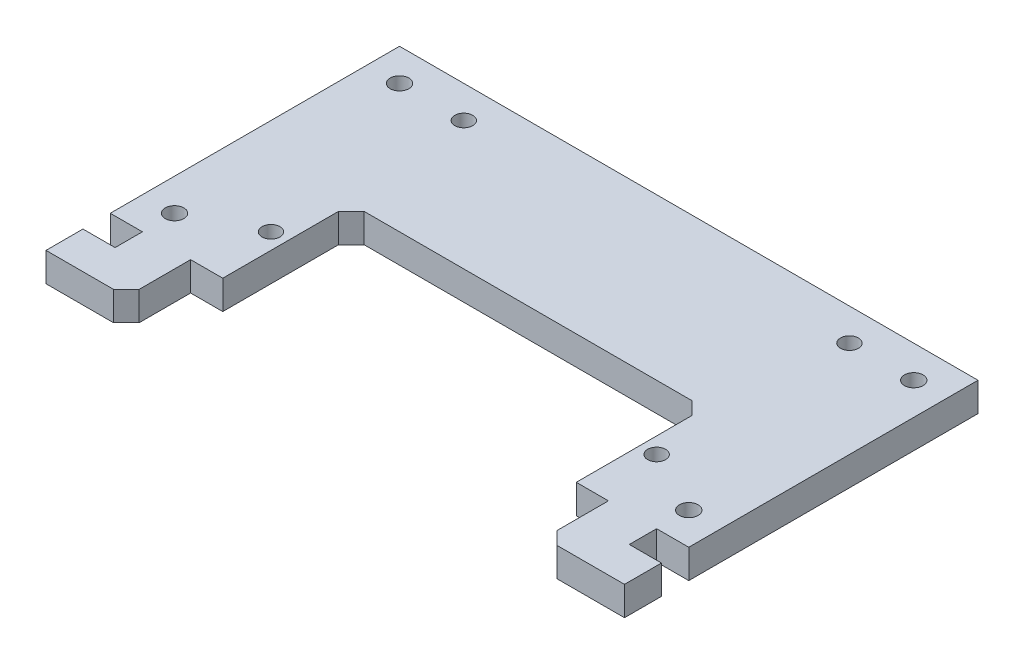
ISO-10303-21;
HEADER;
FILE_DESCRIPTION(('STEP AP214'),'2;1');
FILE_NAME('part.step','',(''),(''),'','','');
FILE_SCHEMA(('AUTOMOTIVE_DESIGN { 1 0 10303 214 1 1 1 1 }'));
ENDSEC;
DATA;
#1=APPLICATION_CONTEXT('core data for automotive mechanical design processes');
#2=APPLICATION_PROTOCOL_DEFINITION('international standard','automotive_design',2000,#1);
#3=PRODUCT_CONTEXT('',#1,'mechanical');
#4=PRODUCT('Part','Part','',(#3));
#5=PRODUCT_RELATED_PRODUCT_CATEGORY('part','',(#4));
#6=PRODUCT_DEFINITION_FORMATION('','',#4);
#7=PRODUCT_DEFINITION_CONTEXT('part definition',#1,'design');
#8=PRODUCT_DEFINITION('design','',#6,#7);
#9=PRODUCT_DEFINITION_SHAPE('','',#8);
#10=(LENGTH_UNIT() NAMED_UNIT(*) SI_UNIT(.MILLI.,.METRE.));
#11=(NAMED_UNIT(*) PLANE_ANGLE_UNIT() SI_UNIT($,.RADIAN.));
#12=(NAMED_UNIT(*) SI_UNIT($,.STERADIAN.) SOLID_ANGLE_UNIT());
#13=UNCERTAINTY_MEASURE_WITH_UNIT(LENGTH_MEASURE(1.E-05),#10,'distance_accuracy_value','');
#14=(GEOMETRIC_REPRESENTATION_CONTEXT(3) GLOBAL_UNCERTAINTY_ASSIGNED_CONTEXT((#13)) GLOBAL_UNIT_ASSIGNED_CONTEXT((#10,
#11,#12)) REPRESENTATION_CONTEXT('',''));
#15=CARTESIAN_POINT('',(0.,0.,0.));
#16=DIRECTION('',(0.,0.,1.));
#17=DIRECTION('',(1.,0.,0.));
#18=AXIS2_PLACEMENT_3D('',#15,#16,#17);
#19=CARTESIAN_POINT('',(-45.,4.5,55.));
#20=DIRECTION('',(0.,0.,-1.));
#21=DIRECTION('',(-1.,0.,0.));
#22=AXIS2_PLACEMENT_3D('',#19,#20,#21);
#23=PLANE('',#22);
#24=DIRECTION('',(1.,0.,0.));
#25=VECTOR('',#24,1.);
#26=CARTESIAN_POINT('',(-45.,0.,55.));
#27=LINE('',#26,#25);
#28=CARTESIAN_POINT('',(-45.,0.,55.));
#29=VERTEX_POINT('',#28);
#30=CARTESIAN_POINT('',(-34.5,0.,55.));
#31=VERTEX_POINT('',#30);
#32=EDGE_CURVE('E369',#29,#31,#27,.T.);
#33=ORIENTED_EDGE('',*,*,#32,.T.);
#34=DIRECTION('',(0.,1.,0.));
#35=VECTOR('',#34,1.);
#36=CARTESIAN_POINT('',(-34.5,4.5,55.));
#37=LINE('',#36,#35);
#38=CARTESIAN_POINT('',(-34.5,4.5,55.));
#39=VERTEX_POINT('',#38);
#40=EDGE_CURVE('E410',#31,#39,#37,.T.);
#41=ORIENTED_EDGE('',*,*,#40,.T.);
#42=DIRECTION('',(1.,0.,0.));
#43=VECTOR('',#42,1.);
#44=CARTESIAN_POINT('',(-45.,4.5,55.));
#45=LINE('',#44,#43);
#46=CARTESIAN_POINT('',(-45.,4.5,55.));
#47=VERTEX_POINT('',#46);
#48=EDGE_CURVE('E355',#47,#39,#45,.T.);
#49=ORIENTED_EDGE('',*,*,#48,.F.);
#50=DIRECTION('',(0.,-1.,0.));
#51=VECTOR('',#50,1.);
#52=CARTESIAN_POINT('',(-45.,4.5,55.));
#53=LINE('',#52,#51);
#54=EDGE_CURVE('E386',#47,#29,#53,.T.);
#55=ORIENTED_EDGE('',*,*,#54,.T.);
#56=EDGE_LOOP('',(#33,#41,#49,#55));
#57=FACE_BOUND('',#56,.T.);
#58=ADVANCED_FACE('F31',(#57),#23,.F.);
#59=CARTESIAN_POINT('',(-45.,4.5,55.));
#60=DIRECTION('',(0.,1.,0.));
#61=DIRECTION('',(0.,0.,1.));
#62=AXIS2_PLACEMENT_3D('',#59,#60,#61);
#63=PLANE('',#62);
#64=DIRECTION('',(0.,0.,-1.));
#65=VECTOR('',#64,1.);
#66=CARTESIAN_POINT('',(32.5,4.5,55.));
#67=LINE('',#66,#65);
#68=CARTESIAN_POINT('',(32.5,4.5,53.));
#69=VERTEX_POINT('',#68);
#70=CARTESIAN_POINT('',(32.5,4.5,45.));
#71=VERTEX_POINT('',#70);
#72=EDGE_CURVE('E212',#69,#71,#67,.T.);
#73=ORIENTED_EDGE('',*,*,#72,.F.);
#74=DIRECTION('',(-0.707106781186548,0.,-0.707106781186548));
#75=VECTOR('',#74,1.);
#76=CARTESIAN_POINT('',(-5.24999999999999,4.5,15.25));
#77=LINE('',#76,#75);
#78=CARTESIAN_POINT('',(34.5,4.5,55.));
#79=VERTEX_POINT('',#78);
#80=EDGE_CURVE('E394',#69,#79,#77,.F.);
#81=ORIENTED_EDGE('',*,*,#80,.T.);
#82=CARTESIAN_POINT('',(45.,4.5,55.));
#83=VERTEX_POINT('',#82);
#84=EDGE_CURVE('E353',#79,#83,#45,.T.);
#85=ORIENTED_EDGE('',*,*,#84,.T.);
#86=DIRECTION('',(0.,0.,-1.));
#87=VECTOR('',#86,1.);
#88=CARTESIAN_POINT('',(45.,4.5,0.));
#89=LINE('',#88,#87);
#90=CARTESIAN_POINT('',(45.,4.5,49.25));
#91=VERTEX_POINT('',#90);
#92=EDGE_CURVE('E359',#83,#91,#89,.T.);
#93=ORIENTED_EDGE('',*,*,#92,.T.);
#94=DIRECTION('',(1.,0.,0.));
#95=VECTOR('',#94,1.);
#96=CARTESIAN_POINT('',(45.,4.5,49.25));
#97=LINE('',#96,#95);
#98=CARTESIAN_POINT('',(40.,4.5,49.25));
#99=VERTEX_POINT('',#98);
#100=EDGE_CURVE('E278',#99,#91,#97,.T.);
#101=ORIENTED_EDGE('',*,*,#100,.F.);
#102=DIRECTION('',(0.,0.,1.));
#103=VECTOR('',#102,1.);
#104=CARTESIAN_POINT('',(40.,4.5,49.25));
#105=LINE('',#104,#103);
#106=CARTESIAN_POINT('',(40.,4.5,45.));
#107=VERTEX_POINT('',#106);
#108=EDGE_CURVE('E287',#107,#99,#105,.T.);
#109=ORIENTED_EDGE('',*,*,#108,.F.);
#110=DIRECTION('',(-1.,0.,0.));
#111=VECTOR('',#110,1.);
#112=CARTESIAN_POINT('',(45.,4.5,45.));
#113=LINE('',#112,#111);
#114=CARTESIAN_POINT('',(45.,4.5,45.));
#115=VERTEX_POINT('',#114);
#116=EDGE_CURVE('E271',#115,#107,#113,.T.);
#117=ORIENTED_EDGE('',*,*,#116,.F.);
#118=CARTESIAN_POINT('',(45.,4.5,0.));
#119=VERTEX_POINT('',#118);
#120=EDGE_CURVE('E358',#115,#119,#89,.T.);
#121=ORIENTED_EDGE('',*,*,#120,.T.);
#122=DIRECTION('',(-1.,0.,0.));
#123=VECTOR('',#122,1.);
#124=CARTESIAN_POINT('',(-45.,4.5,0.));
#125=LINE('',#124,#123);
#126=CARTESIAN_POINT('',(-45.,4.5,0.));
#127=VERTEX_POINT('',#126);
#128=EDGE_CURVE('E362',#119,#127,#125,.T.);
#129=ORIENTED_EDGE('',*,*,#128,.T.);
#130=DIRECTION('',(0.,0.,1.));
#131=VECTOR('',#130,1.);
#132=CARTESIAN_POINT('',(-45.,4.5,0.));
#133=LINE('',#132,#131);
#134=CARTESIAN_POINT('',(-45.,4.5,45.));
#135=VERTEX_POINT('',#134);
#136=EDGE_CURVE('E350',#127,#135,#133,.T.);
#137=ORIENTED_EDGE('',*,*,#136,.T.);
#138=DIRECTION('',(-1.,0.,0.));
#139=VECTOR('',#138,1.);
#140=CARTESIAN_POINT('',(-45.,4.5,45.));
#141=LINE('',#140,#139);
#142=CARTESIAN_POINT('',(-40.,4.5,45.));
#143=VERTEX_POINT('',#142);
#144=EDGE_CURVE('E304',#143,#135,#141,.T.);
#145=ORIENTED_EDGE('',*,*,#144,.F.);
#146=DIRECTION('',(0.,0.,-1.));
#147=VECTOR('',#146,1.);
#148=CARTESIAN_POINT('',(-40.,4.5,45.));
#149=LINE('',#148,#147);
#150=CARTESIAN_POINT('',(-40.,4.5,49.25));
#151=VERTEX_POINT('',#150);
#152=EDGE_CURVE('E313',#151,#143,#149,.T.);
#153=ORIENTED_EDGE('',*,*,#152,.F.);
#154=DIRECTION('',(1.,0.,0.));
#155=VECTOR('',#154,1.);
#156=CARTESIAN_POINT('',(-45.,4.5,49.25));
#157=LINE('',#156,#155);
#158=CARTESIAN_POINT('',(-45.,4.5,49.25));
#159=VERTEX_POINT('',#158);
#160=EDGE_CURVE('E294',#159,#151,#157,.T.);
#161=ORIENTED_EDGE('',*,*,#160,.F.);
#162=EDGE_CURVE('E354',#159,#47,#133,.T.);
#163=ORIENTED_EDGE('',*,*,#162,.T.);
#164=ORIENTED_EDGE('',*,*,#48,.T.);
#165=DIRECTION('',(-0.707106781186548,0.,0.707106781186548));
#166=VECTOR('',#165,1.);
#167=CARTESIAN_POINT('',(-39.75,4.5,60.25));
#168=LINE('',#167,#166);
#169=CARTESIAN_POINT('',(-32.5,4.5,53.));
#170=VERTEX_POINT('',#169);
#171=EDGE_CURVE('E392',#39,#170,#168,.F.);
#172=ORIENTED_EDGE('',*,*,#171,.T.);
#173=DIRECTION('',(0.,0.,1.));
#174=VECTOR('',#173,1.);
#175=CARTESIAN_POINT('',(-32.5,4.5,55.));
#176=LINE('',#175,#174);
#177=CARTESIAN_POINT('',(-32.5,4.5,45.));
#178=VERTEX_POINT('',#177);
#179=EDGE_CURVE('E224',#178,#170,#176,.T.);
#180=ORIENTED_EDGE('',*,*,#179,.F.);
#181=DIRECTION('',(-1.,0.,0.));
#182=VECTOR('',#181,1.);
#183=CARTESIAN_POINT('',(-32.5,4.5,45.));
#184=LINE('',#183,#182);
#185=CARTESIAN_POINT('',(-27.5,4.5,45.));
#186=VERTEX_POINT('',#185);
#187=EDGE_CURVE('E228',#186,#178,#184,.T.);
#188=ORIENTED_EDGE('',*,*,#187,.F.);
#189=DIRECTION('',(0.,0.,1.));
#190=VECTOR('',#189,1.);
#191=CARTESIAN_POINT('',(-27.5,4.5,55.));
#192=LINE('',#191,#190);
#193=CARTESIAN_POINT('',(-27.5,4.5,27.));
#194=VERTEX_POINT('',#193);
#195=EDGE_CURVE('E236',#194,#186,#192,.T.);
#196=ORIENTED_EDGE('',*,*,#195,.F.);
#197=DIRECTION('',(-0.707106781186545,0.,0.70710678118655));
#198=VECTOR('',#197,1.);
#199=CARTESIAN_POINT('',(-27.5,4.5,27.));
#200=LINE('',#199,#198);
#201=CARTESIAN_POINT('',(-25.5,4.5,25.));
#202=VERTEX_POINT('',#201);
#203=EDGE_CURVE('E39',#194,#202,#200,.F.);
#204=ORIENTED_EDGE('',*,*,#203,.T.);
#205=DIRECTION('',(-1.,0.,0.));
#206=VECTOR('',#205,1.);
#207=CARTESIAN_POINT('',(-27.5,4.5,25.));
#208=LINE('',#207,#206);
#209=CARTESIAN_POINT('',(25.5,4.5,25.));
#210=VERTEX_POINT('',#209);
#211=EDGE_CURVE('E240',#210,#202,#208,.T.);
#212=ORIENTED_EDGE('',*,*,#211,.F.);
#213=DIRECTION('',(-0.70710678118655,0.,-0.707106781186545));
#214=VECTOR('',#213,1.);
#215=CARTESIAN_POINT('',(25.5,4.5,25.));
#216=LINE('',#215,#214);
#217=CARTESIAN_POINT('',(27.5,4.5,27.));
#218=VERTEX_POINT('',#217);
#219=EDGE_CURVE('E415',#210,#218,#216,.F.);
#220=ORIENTED_EDGE('',*,*,#219,.T.);
#221=DIRECTION('',(0.,0.,-1.));
#222=VECTOR('',#221,1.);
#223=CARTESIAN_POINT('',(27.5,4.5,55.));
#224=LINE('',#223,#222);
#225=CARTESIAN_POINT('',(27.5,4.5,45.));
#226=VERTEX_POINT('',#225);
#227=EDGE_CURVE('E246',#226,#218,#224,.T.);
#228=ORIENTED_EDGE('',*,*,#227,.F.);
#229=EDGE_CURVE('E229',#71,#226,#184,.T.);
#230=ORIENTED_EDGE('',*,*,#229,.F.);
#231=EDGE_LOOP('',(#73,#81,#85,#93,#101,#109,#117,#121,#129,#137,#145,#153,#161,#163,#164,#172,
#180,#188,#196,#204,#212,#220,#228,#230));
#232=FACE_BOUND('',#231,.T.);
#233=CARTESIAN_POINT('',(30.,4.5,35.));
#234=DIRECTION('',(0.,-1.,0.));
#235=DIRECTION('',(0.,0.,1.));
#236=AXIS2_PLACEMENT_3D('',#233,#234,#235);
#237=CIRCLE('',#236,1.4);
#238=CARTESIAN_POINT('',(30.,4.5,36.4));
#239=VERTEX_POINT('',#238);
#240=EDGE_CURVE('E253',#239,#239,#237,.T.);
#241=ORIENTED_EDGE('',*,*,#240,.T.);
#242=EDGE_LOOP('',(#241));
#243=FACE_BOUND('',#242,.T.);
#244=CARTESIAN_POINT('',(-30.,4.5,5.));
#245=DIRECTION('',(0.,1.,0.));
#246=DIRECTION('',(0.,0.,1.));
#247=AXIS2_PLACEMENT_3D('',#244,#245,#246);
#248=CIRCLE('',#247,1.4);
#249=CARTESIAN_POINT('',(-30.,4.5,6.39999999999999));
#250=VERTEX_POINT('',#249);
#251=EDGE_CURVE('E259',#250,#250,#248,.T.);
#252=ORIENTED_EDGE('',*,*,#251,.F.);
#253=EDGE_LOOP('',(#252));
#254=FACE_BOUND('',#253,.T.);
#255=CARTESIAN_POINT('',(-30.,4.5,35.));
#256=DIRECTION('',(0.,1.,0.));
#257=DIRECTION('',(0.,0.,1.));
#258=AXIS2_PLACEMENT_3D('',#255,#256,#257);
#259=CIRCLE('',#258,1.4);
#260=CARTESIAN_POINT('',(-30.,4.5,36.4));
#261=VERTEX_POINT('',#260);
#262=EDGE_CURVE('E265',#261,#261,#259,.T.);
#263=ORIENTED_EDGE('',*,*,#262,.F.);
#264=EDGE_LOOP('',(#263));
#265=FACE_BOUND('',#264,.T.);
#266=CARTESIAN_POINT('',(40.,4.5,40.));
#267=DIRECTION('',(0.,1.,0.));
#268=DIRECTION('',(0.,0.,1.));
#269=AXIS2_PLACEMENT_3D('',#266,#267,#268);
#270=CIRCLE('',#269,1.45);
#271=CARTESIAN_POINT('',(40.,4.5,41.45));
#272=VERTEX_POINT('',#271);
#273=EDGE_CURVE('E332',#272,#272,#270,.T.);
#274=ORIENTED_EDGE('',*,*,#273,.F.);
#275=EDGE_LOOP('',(#274));
#276=FACE_BOUND('',#275,.T.);
#277=CARTESIAN_POINT('',(-40.,4.5,40.));
#278=DIRECTION('',(0.,1.,0.));
#279=DIRECTION('',(0.,0.,1.));
#280=AXIS2_PLACEMENT_3D('',#277,#278,#279);
#281=CIRCLE('',#280,1.45);
#282=CARTESIAN_POINT('',(-40.,4.5,41.45));
#283=VERTEX_POINT('',#282);
#284=EDGE_CURVE('E344',#283,#283,#281,.T.);
#285=ORIENTED_EDGE('',*,*,#284,.F.);
#286=EDGE_LOOP('',(#285));
#287=FACE_BOUND('',#286,.T.);
#288=CARTESIAN_POINT('',(-40.,4.5,5.));
#289=DIRECTION('',(0.,1.,0.));
#290=DIRECTION('',(0.,0.,1.));
#291=AXIS2_PLACEMENT_3D('',#288,#289,#290);
#292=CIRCLE('',#291,1.45);
#293=CARTESIAN_POINT('',(-40.,4.5,6.45));
#294=VERTEX_POINT('',#293);
#295=EDGE_CURVE('E338',#294,#294,#292,.T.);
#296=ORIENTED_EDGE('',*,*,#295,.F.);
#297=EDGE_LOOP('',(#296));
#298=FACE_BOUND('',#297,.T.);
#299=CARTESIAN_POINT('',(40.,4.5,5.));
#300=DIRECTION('',(0.,1.,0.));
#301=DIRECTION('',(0.,0.,1.));
#302=AXIS2_PLACEMENT_3D('',#299,#300,#301);
#303=CIRCLE('',#302,1.45);
#304=CARTESIAN_POINT('',(40.,4.5,6.45));
#305=VERTEX_POINT('',#304);
#306=EDGE_CURVE('E326',#305,#305,#303,.T.);
#307=ORIENTED_EDGE('',*,*,#306,.F.);
#308=EDGE_LOOP('',(#307));
#309=FACE_BOUND('',#308,.T.);
#310=CARTESIAN_POINT('',(30.,4.5,5.));
#311=DIRECTION('',(0.,-1.,0.));
#312=DIRECTION('',(0.,0.,1.));
#313=AXIS2_PLACEMENT_3D('',#310,#311,#312);
#314=CIRCLE('',#313,1.4);
#315=CARTESIAN_POINT('',(30.,4.5,6.39999999999999));
#316=VERTEX_POINT('',#315);
#317=EDGE_CURVE('E244',#316,#316,#314,.T.);
#318=ORIENTED_EDGE('',*,*,#317,.T.);
#319=EDGE_LOOP('',(#318));
#320=FACE_BOUND('',#319,.T.);
#321=ADVANCED_FACE('F421',(#232,#243,#254,#265,#276,#287,#298,#309,#320),#63,.T.);
#322=CARTESIAN_POINT('',(-45.,0.,55.));
#323=DIRECTION('',(0.,1.,0.));
#324=DIRECTION('',(0.,0.,1.));
#325=AXIS2_PLACEMENT_3D('',#322,#323,#324);
#326=PLANE('',#325);
#327=CARTESIAN_POINT('',(30.,0.,35.));
#328=DIRECTION('',(0.,-1.,0.));
#329=DIRECTION('',(0.,0.,1.));
#330=AXIS2_PLACEMENT_3D('',#327,#328,#329);
#331=CIRCLE('',#330,1.4);
#332=CARTESIAN_POINT('',(30.,0.,36.4));
#333=VERTEX_POINT('',#332);
#334=EDGE_CURVE('E256',#333,#333,#331,.T.);
#335=ORIENTED_EDGE('',*,*,#334,.F.);
#336=EDGE_LOOP('',(#335));
#337=FACE_BOUND('',#336,.T.);
#338=CARTESIAN_POINT('',(-30.,0.,5.));
#339=DIRECTION('',(0.,1.,0.));
#340=DIRECTION('',(0.,0.,1.));
#341=AXIS2_PLACEMENT_3D('',#338,#339,#340);
#342=CIRCLE('',#341,1.4);
#343=CARTESIAN_POINT('',(-30.,0.,6.39999999999999));
#344=VERTEX_POINT('',#343);
#345=EDGE_CURVE('E262',#344,#344,#342,.T.);
#346=ORIENTED_EDGE('',*,*,#345,.T.);
#347=EDGE_LOOP('',(#346));
#348=FACE_BOUND('',#347,.T.);
#349=CARTESIAN_POINT('',(-30.,0.,35.));
#350=DIRECTION('',(0.,1.,0.));
#351=DIRECTION('',(0.,0.,1.));
#352=AXIS2_PLACEMENT_3D('',#349,#350,#351);
#353=CIRCLE('',#352,1.4);
#354=CARTESIAN_POINT('',(-30.,0.,36.4));
#355=VERTEX_POINT('',#354);
#356=EDGE_CURVE('E268',#355,#355,#353,.T.);
#357=ORIENTED_EDGE('',*,*,#356,.T.);
#358=EDGE_LOOP('',(#357));
#359=FACE_BOUND('',#358,.T.);
#360=CARTESIAN_POINT('',(40.,0.,40.));
#361=DIRECTION('',(0.,1.,0.));
#362=DIRECTION('',(0.,0.,1.));
#363=AXIS2_PLACEMENT_3D('',#360,#361,#362);
#364=CIRCLE('',#363,1.45);
#365=CARTESIAN_POINT('',(40.,0.,41.45));
#366=VERTEX_POINT('',#365);
#367=EDGE_CURVE('E329',#366,#366,#364,.T.);
#368=ORIENTED_EDGE('',*,*,#367,.T.);
#369=EDGE_LOOP('',(#368));
#370=FACE_BOUND('',#369,.T.);
#371=CARTESIAN_POINT('',(-40.,0.,40.));
#372=DIRECTION('',(0.,1.,0.));
#373=DIRECTION('',(0.,0.,1.));
#374=AXIS2_PLACEMENT_3D('',#371,#372,#373);
#375=CIRCLE('',#374,1.45);
#376=CARTESIAN_POINT('',(-40.,0.,41.45));
#377=VERTEX_POINT('',#376);
#378=EDGE_CURVE('E341',#377,#377,#375,.T.);
#379=ORIENTED_EDGE('',*,*,#378,.T.);
#380=EDGE_LOOP('',(#379));
#381=FACE_BOUND('',#380,.T.);
#382=CARTESIAN_POINT('',(34.5,0.,55.));
#383=VERTEX_POINT('',#382);
#384=CARTESIAN_POINT('',(45.,0.,55.));
#385=VERTEX_POINT('',#384);
#386=EDGE_CURVE('E368',#383,#385,#27,.T.);
#387=ORIENTED_EDGE('',*,*,#386,.F.);
#388=DIRECTION('',(0.707106781186548,0.,0.707106781186548));
#389=VECTOR('',#388,1.);
#390=CARTESIAN_POINT('',(32.5,0.,53.));
#391=LINE('',#390,#389);
#392=CARTESIAN_POINT('',(32.5,0.,53.));
#393=VERTEX_POINT('',#392);
#394=EDGE_CURVE('E201',#383,#393,#391,.F.);
#395=ORIENTED_EDGE('',*,*,#394,.T.);
#396=DIRECTION('',(0.,0.,-1.));
#397=VECTOR('',#396,1.);
#398=CARTESIAN_POINT('',(32.5,0.,55.));
#399=LINE('',#398,#397);
#400=CARTESIAN_POINT('',(32.5,0.,45.));
#401=VERTEX_POINT('',#400);
#402=EDGE_CURVE('E191',#393,#401,#399,.T.);
#403=ORIENTED_EDGE('',*,*,#402,.T.);
#404=DIRECTION('',(-1.,0.,0.));
#405=VECTOR('',#404,1.);
#406=CARTESIAN_POINT('',(-32.5,0.,45.));
#407=LINE('',#406,#405);
#408=CARTESIAN_POINT('',(27.5,0.,45.));
#409=VERTEX_POINT('',#408);
#410=EDGE_CURVE('E198',#401,#409,#407,.T.);
#411=ORIENTED_EDGE('',*,*,#410,.T.);
#412=DIRECTION('',(0.,0.,-1.));
#413=VECTOR('',#412,1.);
#414=CARTESIAN_POINT('',(27.5,0.,55.));
#415=LINE('',#414,#413);
#416=CARTESIAN_POINT('',(27.5,0.,27.));
#417=VERTEX_POINT('',#416);
#418=EDGE_CURVE('E239',#409,#417,#415,.T.);
#419=ORIENTED_EDGE('',*,*,#418,.T.);
#420=DIRECTION('',(0.70710678118655,0.,0.707106781186545));
#421=VECTOR('',#420,1.);
#422=CARTESIAN_POINT('',(5.24999999999975,0.,4.74999999999991));
#423=LINE('',#422,#421);
#424=CARTESIAN_POINT('',(25.5,0.,25.));
#425=VERTEX_POINT('',#424);
#426=EDGE_CURVE('E417',#417,#425,#423,.F.);
#427=ORIENTED_EDGE('',*,*,#426,.T.);
#428=DIRECTION('',(-1.,0.,0.));
#429=VECTOR('',#428,1.);
#430=CARTESIAN_POINT('',(-27.5,0.,25.));
#431=LINE('',#430,#429);
#432=CARTESIAN_POINT('',(-25.5,0.,25.));
#433=VERTEX_POINT('',#432);
#434=EDGE_CURVE('E242',#425,#433,#431,.T.);
#435=ORIENTED_EDGE('',*,*,#434,.T.);
#436=DIRECTION('',(0.707106781186545,0.,-0.70710678118655));
#437=VECTOR('',#436,1.);
#438=CARTESIAN_POINT('',(-50.2499999999999,0.,49.7500000000001));
#439=LINE('',#438,#437);
#440=CARTESIAN_POINT('',(-27.5,0.,27.));
#441=VERTEX_POINT('',#440);
#442=EDGE_CURVE('E11',#433,#441,#439,.F.);
#443=ORIENTED_EDGE('',*,*,#442,.T.);
#444=DIRECTION('',(0.,0.,1.));
#445=VECTOR('',#444,1.);
#446=CARTESIAN_POINT('',(-27.5,0.,55.));
#447=LINE('',#446,#445);
#448=CARTESIAN_POINT('',(-27.5,0.,45.));
#449=VERTEX_POINT('',#448);
#450=EDGE_CURVE('E237',#441,#449,#447,.T.);
#451=ORIENTED_EDGE('',*,*,#450,.T.);
#452=CARTESIAN_POINT('',(-32.5,0.,45.));
#453=VERTEX_POINT('',#452);
#454=EDGE_CURVE('E205',#449,#453,#407,.T.);
#455=ORIENTED_EDGE('',*,*,#454,.T.);
#456=DIRECTION('',(0.,0.,1.));
#457=VECTOR('',#456,1.);
#458=CARTESIAN_POINT('',(-32.5,0.,55.));
#459=LINE('',#458,#457);
#460=CARTESIAN_POINT('',(-32.5,0.,53.));
#461=VERTEX_POINT('',#460);
#462=EDGE_CURVE('E206',#453,#461,#459,.T.);
#463=ORIENTED_EDGE('',*,*,#462,.T.);
#464=DIRECTION('',(0.707106781186548,0.,-0.707106781186548));
#465=VECTOR('',#464,1.);
#466=CARTESIAN_POINT('',(-34.5,0.,55.));
#467=LINE('',#466,#465);
#468=EDGE_CURVE('E398',#461,#31,#467,.F.);
#469=ORIENTED_EDGE('',*,*,#468,.T.);
#470=ORIENTED_EDGE('',*,*,#32,.F.);
#471=DIRECTION('',(0.,0.,1.));
#472=VECTOR('',#471,1.);
#473=CARTESIAN_POINT('',(-45.,0.,0.));
#474=LINE('',#473,#472);
#475=CARTESIAN_POINT('',(-45.,0.,49.25));
#476=VERTEX_POINT('',#475);
#477=EDGE_CURVE('E347',#476,#29,#474,.T.);
#478=ORIENTED_EDGE('',*,*,#477,.F.);
#479=DIRECTION('',(1.,0.,0.));
#480=VECTOR('',#479,1.);
#481=CARTESIAN_POINT('',(-45.,0.,49.25));
#482=LINE('',#481,#480);
#483=CARTESIAN_POINT('',(-40.,0.,49.25));
#484=VERTEX_POINT('',#483);
#485=EDGE_CURVE('E300',#476,#484,#482,.T.);
#486=ORIENTED_EDGE('',*,*,#485,.T.);
#487=DIRECTION('',(0.,0.,-1.));
#488=VECTOR('',#487,1.);
#489=CARTESIAN_POINT('',(-40.,0.,45.));
#490=LINE('',#489,#488);
#491=CARTESIAN_POINT('',(-40.,0.,45.));
#492=VERTEX_POINT('',#491);
#493=EDGE_CURVE('E303',#484,#492,#490,.T.);
#494=ORIENTED_EDGE('',*,*,#493,.T.);
#495=DIRECTION('',(-1.,0.,0.));
#496=VECTOR('',#495,1.);
#497=CARTESIAN_POINT('',(-45.,0.,45.));
#498=LINE('',#497,#496);
#499=CARTESIAN_POINT('',(-45.,0.,45.));
#500=VERTEX_POINT('',#499);
#501=EDGE_CURVE('E307',#492,#500,#498,.T.);
#502=ORIENTED_EDGE('',*,*,#501,.T.);
#503=CARTESIAN_POINT('',(-45.,0.,0.));
#504=VERTEX_POINT('',#503);
#505=EDGE_CURVE('E365',#504,#500,#474,.T.);
#506=ORIENTED_EDGE('',*,*,#505,.F.);
#507=DIRECTION('',(-1.,0.,0.));
#508=VECTOR('',#507,1.);
#509=CARTESIAN_POINT('',(-45.,0.,0.));
#510=LINE('',#509,#508);
#511=CARTESIAN_POINT('',(45.,0.,0.));
#512=VERTEX_POINT('',#511);
#513=EDGE_CURVE('E376',#512,#504,#510,.T.);
#514=ORIENTED_EDGE('',*,*,#513,.F.);
#515=DIRECTION('',(0.,0.,-1.));
#516=VECTOR('',#515,1.);
#517=CARTESIAN_POINT('',(45.,0.,0.));
#518=LINE('',#517,#516);
#519=CARTESIAN_POINT('',(45.,0.,45.));
#520=VERTEX_POINT('',#519);
#521=EDGE_CURVE('E372',#520,#512,#518,.T.);
#522=ORIENTED_EDGE('',*,*,#521,.F.);
#523=DIRECTION('',(-1.,0.,0.));
#524=VECTOR('',#523,1.);
#525=CARTESIAN_POINT('',(45.,0.,45.));
#526=LINE('',#525,#524);
#527=CARTESIAN_POINT('',(40.,0.,45.));
#528=VERTEX_POINT('',#527);
#529=EDGE_CURVE('E274',#520,#528,#526,.T.);
#530=ORIENTED_EDGE('',*,*,#529,.T.);
#531=DIRECTION('',(0.,0.,1.));
#532=VECTOR('',#531,1.);
#533=CARTESIAN_POINT('',(40.,0.,49.25));
#534=LINE('',#533,#532);
#535=CARTESIAN_POINT('',(40.,0.,49.25));
#536=VERTEX_POINT('',#535);
#537=EDGE_CURVE('E277',#528,#536,#534,.T.);
#538=ORIENTED_EDGE('',*,*,#537,.T.);
#539=DIRECTION('',(1.,0.,0.));
#540=VECTOR('',#539,1.);
#541=CARTESIAN_POINT('',(45.,0.,49.25));
#542=LINE('',#541,#540);
#543=CARTESIAN_POINT('',(45.,0.,49.25));
#544=VERTEX_POINT('',#543);
#545=EDGE_CURVE('E281',#536,#544,#542,.T.);
#546=ORIENTED_EDGE('',*,*,#545,.T.);
#547=EDGE_CURVE('E373',#385,#544,#518,.T.);
#548=ORIENTED_EDGE('',*,*,#547,.F.);
#549=EDGE_LOOP('',(#387,#395,#403,#411,#419,#427,#435,#443,#451,#455,#463,#469,#470,#478,#486,
#494,#502,#506,#514,#522,#530,#538,#546,#548));
#550=FACE_BOUND('',#549,.T.);
#551=CARTESIAN_POINT('',(-40.,0.,5.));
#552=DIRECTION('',(0.,1.,0.));
#553=DIRECTION('',(0.,0.,1.));
#554=AXIS2_PLACEMENT_3D('',#551,#552,#553);
#555=CIRCLE('',#554,1.45);
#556=CARTESIAN_POINT('',(-40.,0.,6.45));
#557=VERTEX_POINT('',#556);
#558=EDGE_CURVE('E335',#557,#557,#555,.T.);
#559=ORIENTED_EDGE('',*,*,#558,.T.);
#560=EDGE_LOOP('',(#559));
#561=FACE_BOUND('',#560,.T.);
#562=CARTESIAN_POINT('',(40.,0.,5.));
#563=DIRECTION('',(0.,1.,0.));
#564=DIRECTION('',(0.,0.,1.));
#565=AXIS2_PLACEMENT_3D('',#562,#563,#564);
#566=CIRCLE('',#565,1.45);
#567=CARTESIAN_POINT('',(40.,0.,6.45));
#568=VERTEX_POINT('',#567);
#569=EDGE_CURVE('E320',#568,#568,#566,.T.);
#570=ORIENTED_EDGE('',*,*,#569,.T.);
#571=EDGE_LOOP('',(#570));
#572=FACE_BOUND('',#571,.T.);
#573=CARTESIAN_POINT('',(30.,0.,5.));
#574=DIRECTION('',(0.,-1.,0.));
#575=DIRECTION('',(0.,0.,1.));
#576=AXIS2_PLACEMENT_3D('',#573,#574,#575);
#577=CIRCLE('',#576,1.4);
#578=CARTESIAN_POINT('',(30.,0.,6.39999999999999));
#579=VERTEX_POINT('',#578);
#580=EDGE_CURVE('E250',#579,#579,#577,.T.);
#581=ORIENTED_EDGE('',*,*,#580,.F.);
#582=EDGE_LOOP('',(#581));
#583=FACE_BOUND('',#582,.T.);
#584=ADVANCED_FACE('F194',(#337,#348,#359,#370,#381,#550,#561,#572,#583),#326,.F.);
#585=CARTESIAN_POINT('',(45.,4.5,0.));
#586=DIRECTION('',(-1.,0.,0.));
#587=DIRECTION('',(0.,0.,1.));
#588=AXIS2_PLACEMENT_3D('',#585,#586,#587);
#589=PLANE('',#588);
#590=ORIENTED_EDGE('',*,*,#547,.T.);
#591=DIRECTION('',(0.,1.,0.));
#592=VECTOR('',#591,1.);
#593=CARTESIAN_POINT('',(45.,0.,49.25));
#594=LINE('',#593,#592);
#595=EDGE_CURVE('E291',#544,#91,#594,.T.);
#596=ORIENTED_EDGE('',*,*,#595,.T.);
#597=ORIENTED_EDGE('',*,*,#92,.F.);
#598=DIRECTION('',(0.,-1.,0.));
#599=VECTOR('',#598,1.);
#600=CARTESIAN_POINT('',(45.,4.5,55.));
#601=LINE('',#600,#599);
#602=EDGE_CURVE('E383',#83,#385,#601,.T.);
#603=ORIENTED_EDGE('',*,*,#602,.T.);
#604=EDGE_LOOP('',(#590,#596,#597,#603));
#605=FACE_BOUND('',#604,.T.);
#606=ADVANCED_FACE('F491',(#605),#589,.F.);
#607=CARTESIAN_POINT('',(-45.,4.5,0.));
#608=DIRECTION('',(1.,0.,0.));
#609=DIRECTION('',(0.,0.,-1.));
#610=AXIS2_PLACEMENT_3D('',#607,#608,#609);
#611=PLANE('',#610);
#612=ORIENTED_EDGE('',*,*,#505,.T.);
#613=DIRECTION('',(0.,1.,0.));
#614=VECTOR('',#613,1.);
#615=CARTESIAN_POINT('',(-45.,0.,45.));
#616=LINE('',#615,#614);
#617=EDGE_CURVE('E317',#500,#135,#616,.T.);
#618=ORIENTED_EDGE('',*,*,#617,.T.);
#619=ORIENTED_EDGE('',*,*,#136,.F.);
#620=DIRECTION('',(0.,-1.,0.));
#621=VECTOR('',#620,1.);
#622=CARTESIAN_POINT('',(-45.,4.5,0.));
#623=LINE('',#622,#621);
#624=EDGE_CURVE('E364',#127,#504,#623,.T.);
#625=ORIENTED_EDGE('',*,*,#624,.T.);
#626=EDGE_LOOP('',(#612,#618,#619,#625));
#627=FACE_BOUND('',#626,.T.);
#628=ADVANCED_FACE('F467',(#627),#611,.F.);
#629=ORIENTED_EDGE('',*,*,#162,.F.);
#630=DIRECTION('',(0.,1.,0.));
#631=VECTOR('',#630,1.);
#632=CARTESIAN_POINT('',(-45.,0.,49.25));
#633=LINE('',#632,#631);
#634=EDGE_CURVE('E310',#476,#159,#633,.T.);
#635=ORIENTED_EDGE('',*,*,#634,.F.);
#636=ORIENTED_EDGE('',*,*,#477,.T.);
#637=ORIENTED_EDGE('',*,*,#54,.F.);
#638=EDGE_LOOP('',(#629,#635,#636,#637));
#639=FACE_BOUND('',#638,.T.);
#640=ADVANCED_FACE('F453',(#639),#611,.F.);
#641=ORIENTED_EDGE('',*,*,#84,.F.);
#642=DIRECTION('',(0.,-1.,0.));
#643=VECTOR('',#642,1.);
#644=CARTESIAN_POINT('',(34.5,4.5,55.));
#645=LINE('',#644,#643);
#646=EDGE_CURVE('E396',#79,#383,#645,.T.);
#647=ORIENTED_EDGE('',*,*,#646,.T.);
#648=ORIENTED_EDGE('',*,*,#386,.T.);
#649=ORIENTED_EDGE('',*,*,#602,.F.);
#650=EDGE_LOOP('',(#641,#647,#648,#649));
#651=FACE_BOUND('',#650,.T.);
#652=ADVANCED_FACE('F496',(#651),#23,.F.);
#653=ORIENTED_EDGE('',*,*,#120,.F.);
#654=DIRECTION('',(0.,1.,0.));
#655=VECTOR('',#654,1.);
#656=CARTESIAN_POINT('',(45.,0.,45.));
#657=LINE('',#656,#655);
#658=EDGE_CURVE('E284',#520,#115,#657,.T.);
#659=ORIENTED_EDGE('',*,*,#658,.F.);
#660=ORIENTED_EDGE('',*,*,#521,.T.);
#661=DIRECTION('',(0.,-1.,0.));
#662=VECTOR('',#661,1.);
#663=CARTESIAN_POINT('',(45.,4.5,0.));
#664=LINE('',#663,#662);
#665=EDGE_CURVE('E380',#119,#512,#664,.T.);
#666=ORIENTED_EDGE('',*,*,#665,.F.);
#667=EDGE_LOOP('',(#653,#659,#660,#666));
#668=FACE_BOUND('',#667,.T.);
#669=ADVANCED_FACE('F478',(#668),#589,.F.);
#670=CARTESIAN_POINT('',(-45.,4.5,0.));
#671=DIRECTION('',(0.,0.,1.));
#672=DIRECTION('',(1.,0.,0.));
#673=AXIS2_PLACEMENT_3D('',#670,#671,#672);
#674=PLANE('',#673);
#675=ORIENTED_EDGE('',*,*,#513,.T.);
#676=ORIENTED_EDGE('',*,*,#624,.F.);
#677=ORIENTED_EDGE('',*,*,#128,.F.);
#678=ORIENTED_EDGE('',*,*,#665,.T.);
#679=EDGE_LOOP('',(#675,#676,#677,#678));
#680=FACE_BOUND('',#679,.T.);
#681=ADVANCED_FACE('F472',(#680),#674,.F.);
#682=CARTESIAN_POINT('',(-40.,4.5,40.));
#683=DIRECTION('',(0.,-1.,0.));
#684=DIRECTION('',(0.,0.,-1.));
#685=AXIS2_PLACEMENT_3D('',#682,#683,#684);
#686=CYLINDRICAL_SURFACE('',#685,1.45);
#687=ORIENTED_EDGE('',*,*,#284,.T.);
#688=EDGE_LOOP('',(#687));
#689=FACE_BOUND('',#688,.T.);
#690=ORIENTED_EDGE('',*,*,#378,.F.);
#691=EDGE_LOOP('',(#690));
#692=FACE_BOUND('',#691,.T.);
#693=ADVANCED_FACE('F540',(#689,#692),#686,.F.);
#694=CARTESIAN_POINT('',(-40.,4.5,5.));
#695=DIRECTION('',(0.,-1.,0.));
#696=DIRECTION('',(0.,0.,-1.));
#697=AXIS2_PLACEMENT_3D('',#694,#695,#696);
#698=CYLINDRICAL_SURFACE('',#697,1.45);
#699=ORIENTED_EDGE('',*,*,#295,.T.);
#700=EDGE_LOOP('',(#699));
#701=FACE_BOUND('',#700,.T.);
#702=ORIENTED_EDGE('',*,*,#558,.F.);
#703=EDGE_LOOP('',(#702));
#704=FACE_BOUND('',#703,.T.);
#705=ADVANCED_FACE('F544',(#701,#704),#698,.F.);
#706=CARTESIAN_POINT('',(40.,4.5,40.));
#707=DIRECTION('',(0.,-1.,0.));
#708=DIRECTION('',(0.,0.,-1.));
#709=AXIS2_PLACEMENT_3D('',#706,#707,#708);
#710=CYLINDRICAL_SURFACE('',#709,1.45);
#711=ORIENTED_EDGE('',*,*,#273,.T.);
#712=EDGE_LOOP('',(#711));
#713=FACE_BOUND('',#712,.T.);
#714=ORIENTED_EDGE('',*,*,#367,.F.);
#715=EDGE_LOOP('',(#714));
#716=FACE_BOUND('',#715,.T.);
#717=ADVANCED_FACE('F548',(#713,#716),#710,.F.);
#718=CARTESIAN_POINT('',(40.,4.5,5.));
#719=DIRECTION('',(0.,-1.,0.));
#720=DIRECTION('',(0.,0.,-1.));
#721=AXIS2_PLACEMENT_3D('',#718,#719,#720);
#722=CYLINDRICAL_SURFACE('',#721,1.45);
#723=ORIENTED_EDGE('',*,*,#306,.T.);
#724=EDGE_LOOP('',(#723));
#725=FACE_BOUND('',#724,.T.);
#726=ORIENTED_EDGE('',*,*,#569,.F.);
#727=EDGE_LOOP('',(#726));
#728=FACE_BOUND('',#727,.T.);
#729=ADVANCED_FACE('F552',(#725,#728),#722,.F.);
#730=CARTESIAN_POINT('',(-45.,0.,45.));
#731=DIRECTION('',(0.,0.,-1.));
#732=DIRECTION('',(-1.,0.,0.));
#733=AXIS2_PLACEMENT_3D('',#730,#731,#732);
#734=PLANE('',#733);
#735=ORIENTED_EDGE('',*,*,#144,.T.);
#736=ORIENTED_EDGE('',*,*,#617,.F.);
#737=ORIENTED_EDGE('',*,*,#501,.F.);
#738=DIRECTION('',(0.,1.,0.));
#739=VECTOR('',#738,1.);
#740=CARTESIAN_POINT('',(-40.,0.,45.));
#741=LINE('',#740,#739);
#742=EDGE_CURVE('E321',#492,#143,#741,.T.);
#743=ORIENTED_EDGE('',*,*,#742,.T.);
#744=EDGE_LOOP('',(#735,#736,#737,#743));
#745=FACE_BOUND('',#744,.T.);
#746=ADVANCED_FACE('F463',(#745),#734,.F.);
#747=CARTESIAN_POINT('',(-40.,0.,45.));
#748=DIRECTION('',(1.,0.,0.));
#749=DIRECTION('',(0.,0.,-1.));
#750=AXIS2_PLACEMENT_3D('',#747,#748,#749);
#751=PLANE('',#750);
#752=ORIENTED_EDGE('',*,*,#152,.T.);
#753=ORIENTED_EDGE('',*,*,#742,.F.);
#754=ORIENTED_EDGE('',*,*,#493,.F.);
#755=DIRECTION('',(0.,1.,0.));
#756=VECTOR('',#755,1.);
#757=CARTESIAN_POINT('',(-40.,0.,49.25));
#758=LINE('',#757,#756);
#759=EDGE_CURVE('E323',#484,#151,#758,.T.);
#760=ORIENTED_EDGE('',*,*,#759,.T.);
#761=EDGE_LOOP('',(#752,#753,#754,#760));
#762=FACE_BOUND('',#761,.T.);
#763=ADVANCED_FACE('F459',(#762),#751,.F.);
#764=CARTESIAN_POINT('',(-45.,0.,49.25));
#765=DIRECTION('',(0.,0.,1.));
#766=DIRECTION('',(1.,0.,0.));
#767=AXIS2_PLACEMENT_3D('',#764,#765,#766);
#768=PLANE('',#767);
#769=ORIENTED_EDGE('',*,*,#160,.T.);
#770=ORIENTED_EDGE('',*,*,#759,.F.);
#771=ORIENTED_EDGE('',*,*,#485,.F.);
#772=ORIENTED_EDGE('',*,*,#634,.T.);
#773=EDGE_LOOP('',(#769,#770,#771,#772));
#774=FACE_BOUND('',#773,.T.);
#775=ADVANCED_FACE('F457',(#774),#768,.F.);
#776=CARTESIAN_POINT('',(45.,0.,49.25));
#777=DIRECTION('',(0.,0.,1.));
#778=DIRECTION('',(1.,0.,0.));
#779=AXIS2_PLACEMENT_3D('',#776,#777,#778);
#780=PLANE('',#779);
#781=ORIENTED_EDGE('',*,*,#100,.T.);
#782=ORIENTED_EDGE('',*,*,#595,.F.);
#783=ORIENTED_EDGE('',*,*,#545,.F.);
#784=DIRECTION('',(0.,1.,0.));
#785=VECTOR('',#784,1.);
#786=CARTESIAN_POINT('',(40.,0.,49.25));
#787=LINE('',#786,#785);
#788=EDGE_CURVE('E295',#536,#99,#787,.T.);
#789=ORIENTED_EDGE('',*,*,#788,.T.);
#790=EDGE_LOOP('',(#781,#782,#783,#789));
#791=FACE_BOUND('',#790,.T.);
#792=ADVANCED_FACE('F559',(#791),#780,.F.);
#793=CARTESIAN_POINT('',(40.,0.,49.25));
#794=DIRECTION('',(-1.,0.,0.));
#795=DIRECTION('',(0.,0.,1.));
#796=AXIS2_PLACEMENT_3D('',#793,#794,#795);
#797=PLANE('',#796);
#798=ORIENTED_EDGE('',*,*,#108,.T.);
#799=ORIENTED_EDGE('',*,*,#788,.F.);
#800=ORIENTED_EDGE('',*,*,#537,.F.);
#801=DIRECTION('',(0.,1.,0.));
#802=VECTOR('',#801,1.);
#803=CARTESIAN_POINT('',(40.,0.,45.));
#804=LINE('',#803,#802);
#805=EDGE_CURVE('E297',#528,#107,#804,.T.);
#806=ORIENTED_EDGE('',*,*,#805,.T.);
#807=EDGE_LOOP('',(#798,#799,#800,#806));
#808=FACE_BOUND('',#807,.T.);
#809=ADVANCED_FACE('F485',(#808),#797,.F.);
#810=CARTESIAN_POINT('',(45.,0.,45.));
#811=DIRECTION('',(0.,0.,-1.));
#812=DIRECTION('',(-1.,0.,0.));
#813=AXIS2_PLACEMENT_3D('',#810,#811,#812);
#814=PLANE('',#813);
#815=ORIENTED_EDGE('',*,*,#116,.T.);
#816=ORIENTED_EDGE('',*,*,#805,.F.);
#817=ORIENTED_EDGE('',*,*,#529,.F.);
#818=ORIENTED_EDGE('',*,*,#658,.T.);
#819=EDGE_LOOP('',(#815,#816,#817,#818));
#820=FACE_BOUND('',#819,.T.);
#821=ADVANCED_FACE('F481',(#820),#814,.F.);
#822=CARTESIAN_POINT('',(-30.,0.,35.));
#823=DIRECTION('',(0.,1.,0.));
#824=DIRECTION('',(0.,0.,1.));
#825=AXIS2_PLACEMENT_3D('',#822,#823,#824);
#826=CYLINDRICAL_SURFACE('',#825,1.4);
#827=ORIENTED_EDGE('',*,*,#356,.F.);
#828=EDGE_LOOP('',(#827));
#829=FACE_BOUND('',#828,.T.);
#830=ORIENTED_EDGE('',*,*,#262,.T.);
#831=EDGE_LOOP('',(#830));
#832=FACE_BOUND('',#831,.T.);
#833=ADVANCED_FACE('F566',(#829,#832),#826,.F.);
#834=CARTESIAN_POINT('',(-30.,0.,5.));
#835=DIRECTION('',(0.,1.,0.));
#836=DIRECTION('',(0.,0.,1.));
#837=AXIS2_PLACEMENT_3D('',#834,#835,#836);
#838=CYLINDRICAL_SURFACE('',#837,1.4);
#839=ORIENTED_EDGE('',*,*,#345,.F.);
#840=EDGE_LOOP('',(#839));
#841=FACE_BOUND('',#840,.T.);
#842=ORIENTED_EDGE('',*,*,#251,.T.);
#843=EDGE_LOOP('',(#842));
#844=FACE_BOUND('',#843,.T.);
#845=ADVANCED_FACE('F573',(#841,#844),#838,.F.);
#846=CARTESIAN_POINT('',(30.,0.,35.));
#847=DIRECTION('',(0.,1.,0.));
#848=DIRECTION('',(0.,0.,1.));
#849=AXIS2_PLACEMENT_3D('',#846,#847,#848);
#850=CYLINDRICAL_SURFACE('',#849,1.4);
#851=ORIENTED_EDGE('',*,*,#334,.T.);
#852=EDGE_LOOP('',(#851));
#853=FACE_BOUND('',#852,.T.);
#854=ORIENTED_EDGE('',*,*,#240,.F.);
#855=EDGE_LOOP('',(#854));
#856=FACE_BOUND('',#855,.T.);
#857=ADVANCED_FACE('F577',(#853,#856),#850,.F.);
#858=CARTESIAN_POINT('',(30.,0.,5.));
#859=DIRECTION('',(0.,1.,0.));
#860=DIRECTION('',(0.,0.,1.));
#861=AXIS2_PLACEMENT_3D('',#858,#859,#860);
#862=CYLINDRICAL_SURFACE('',#861,1.4);
#863=ORIENTED_EDGE('',*,*,#580,.T.);
#864=EDGE_LOOP('',(#863));
#865=FACE_BOUND('',#864,.T.);
#866=ORIENTED_EDGE('',*,*,#317,.F.);
#867=EDGE_LOOP('',(#866));
#868=FACE_BOUND('',#867,.T.);
#869=ADVANCED_FACE('F581',(#865,#868),#862,.F.);
#870=CARTESIAN_POINT('',(-27.5,0.,55.));
#871=DIRECTION('',(-1.,0.,0.));
#872=DIRECTION('',(0.,0.,1.));
#873=AXIS2_PLACEMENT_3D('',#870,#871,#872);
#874=PLANE('',#873);
#875=ORIENTED_EDGE('',*,*,#450,.F.);
#876=DIRECTION('',(0.,1.,0.));
#877=VECTOR('',#876,1.);
#878=CARTESIAN_POINT('',(-27.5,4.5,27.));
#879=LINE('',#878,#877);
#880=EDGE_CURVE('E407',#441,#194,#879,.T.);
#881=ORIENTED_EDGE('',*,*,#880,.T.);
#882=ORIENTED_EDGE('',*,*,#195,.T.);
#883=DIRECTION('',(0.,-1.,0.));
#884=VECTOR('',#883,1.);
#885=CARTESIAN_POINT('',(-27.5,0.,45.));
#886=LINE('',#885,#884);
#887=EDGE_CURVE('E232',#186,#449,#886,.T.);
#888=ORIENTED_EDGE('',*,*,#887,.T.);
#889=EDGE_LOOP('',(#875,#881,#882,#888));
#890=FACE_BOUND('',#889,.T.);
#891=ADVANCED_FACE('F430',(#890),#874,.F.);
#892=CARTESIAN_POINT('',(-27.5,0.,25.));
#893=DIRECTION('',(0.,0.,-1.));
#894=DIRECTION('',(-1.,0.,0.));
#895=AXIS2_PLACEMENT_3D('',#892,#893,#894);
#896=PLANE('',#895);
#897=ORIENTED_EDGE('',*,*,#434,.F.);
#898=DIRECTION('',(0.,1.,0.));
#899=VECTOR('',#898,1.);
#900=CARTESIAN_POINT('',(25.5,4.5,25.));
#901=LINE('',#900,#899);
#902=EDGE_CURVE('E402',#425,#210,#901,.T.);
#903=ORIENTED_EDGE('',*,*,#902,.T.);
#904=ORIENTED_EDGE('',*,*,#211,.T.);
#905=DIRECTION('',(0.,-1.,0.));
#906=VECTOR('',#905,1.);
#907=CARTESIAN_POINT('',(-25.5,0.,25.));
#908=LINE('',#907,#906);
#909=EDGE_CURVE('E52',#202,#433,#908,.T.);
#910=ORIENTED_EDGE('',*,*,#909,.T.);
#911=EDGE_LOOP('',(#897,#903,#904,#910));
#912=FACE_BOUND('',#911,.T.);
#913=ADVANCED_FACE('F426',(#912),#896,.F.);
#914=CARTESIAN_POINT('',(27.5,0.,55.));
#915=DIRECTION('',(1.,0.,0.));
#916=DIRECTION('',(0.,0.,-1.));
#917=AXIS2_PLACEMENT_3D('',#914,#915,#916);
#918=PLANE('',#917);
#919=ORIENTED_EDGE('',*,*,#227,.T.);
#920=DIRECTION('',(0.,-1.,0.));
#921=VECTOR('',#920,1.);
#922=CARTESIAN_POINT('',(27.5,0.,27.));
#923=LINE('',#922,#921);
#924=EDGE_CURVE('E405',#218,#417,#923,.T.);
#925=ORIENTED_EDGE('',*,*,#924,.T.);
#926=ORIENTED_EDGE('',*,*,#418,.F.);
#927=DIRECTION('',(0.,1.,0.));
#928=VECTOR('',#927,1.);
#929=CARTESIAN_POINT('',(27.5,0.,45.));
#930=LINE('',#929,#928);
#931=EDGE_CURVE('E219',#409,#226,#930,.T.);
#932=ORIENTED_EDGE('',*,*,#931,.T.);
#933=EDGE_LOOP('',(#919,#925,#926,#932));
#934=FACE_BOUND('',#933,.T.);
#935=ADVANCED_FACE('F502',(#934),#918,.F.);
#936=CARTESIAN_POINT('',(-32.5,0.,45.));
#937=DIRECTION('',(0.,0.,-1.));
#938=DIRECTION('',(-1.,0.,0.));
#939=AXIS2_PLACEMENT_3D('',#936,#937,#938);
#940=PLANE('',#939);
#941=ORIENTED_EDGE('',*,*,#410,.F.);
#942=DIRECTION('',(0.,1.,0.));
#943=VECTOR('',#942,1.);
#944=CARTESIAN_POINT('',(32.5,0.,45.));
#945=LINE('',#944,#943);
#946=EDGE_CURVE('E209',#401,#71,#945,.T.);
#947=ORIENTED_EDGE('',*,*,#946,.T.);
#948=ORIENTED_EDGE('',*,*,#229,.T.);
#949=ORIENTED_EDGE('',*,*,#931,.F.);
#950=EDGE_LOOP('',(#941,#947,#948,#949));
#951=FACE_BOUND('',#950,.T.);
#952=ADVANCED_FACE('F217',(#951),#940,.F.);
#953=CARTESIAN_POINT('',(32.5,0.,55.));
#954=DIRECTION('',(1.,0.,0.));
#955=DIRECTION('',(0.,0.,-1.));
#956=AXIS2_PLACEMENT_3D('',#953,#954,#955);
#957=PLANE('',#956);
#958=ORIENTED_EDGE('',*,*,#402,.F.);
#959=DIRECTION('',(0.,1.,0.));
#960=VECTOR('',#959,1.);
#961=CARTESIAN_POINT('',(32.5,0.,53.));
#962=LINE('',#961,#960);
#963=EDGE_CURVE('E390',#393,#69,#962,.T.);
#964=ORIENTED_EDGE('',*,*,#963,.T.);
#965=ORIENTED_EDGE('',*,*,#72,.T.);
#966=ORIENTED_EDGE('',*,*,#946,.F.);
#967=EDGE_LOOP('',(#958,#964,#965,#966));
#968=FACE_BOUND('',#967,.T.);
#969=ADVANCED_FACE('F210',(#968),#957,.F.);
#970=ORIENTED_EDGE('',*,*,#187,.T.);
#971=DIRECTION('',(0.,1.,0.));
#972=VECTOR('',#971,1.);
#973=CARTESIAN_POINT('',(-32.5,0.,45.));
#974=LINE('',#973,#972);
#975=EDGE_CURVE('E215',#453,#178,#974,.T.);
#976=ORIENTED_EDGE('',*,*,#975,.F.);
#977=ORIENTED_EDGE('',*,*,#454,.F.);
#978=ORIENTED_EDGE('',*,*,#887,.F.);
#979=EDGE_LOOP('',(#970,#976,#977,#978));
#980=FACE_BOUND('',#979,.T.);
#981=ADVANCED_FACE('F435',(#980),#940,.F.);
#982=CARTESIAN_POINT('',(-32.5,0.,55.));
#983=DIRECTION('',(-1.,0.,0.));
#984=DIRECTION('',(0.,0.,1.));
#985=AXIS2_PLACEMENT_3D('',#982,#983,#984);
#986=PLANE('',#985);
#987=ORIENTED_EDGE('',*,*,#179,.T.);
#988=DIRECTION('',(0.,-1.,0.));
#989=VECTOR('',#988,1.);
#990=CARTESIAN_POINT('',(-32.5,0.,53.));
#991=LINE('',#990,#989);
#992=EDGE_CURVE('E413',#170,#461,#991,.T.);
#993=ORIENTED_EDGE('',*,*,#992,.T.);
#994=ORIENTED_EDGE('',*,*,#462,.F.);
#995=ORIENTED_EDGE('',*,*,#975,.T.);
#996=EDGE_LOOP('',(#987,#993,#994,#995));
#997=FACE_BOUND('',#996,.T.);
#998=ADVANCED_FACE('F439',(#997),#986,.F.);
#999=CARTESIAN_POINT('',(32.5,0.,53.));
#1000=DIRECTION('',(0.707106781186547,0.,-0.707106781186547));
#1001=DIRECTION('',(-0.707106781186548,0.,-0.707106781186548));
#1002=AXIS2_PLACEMENT_3D('',#999,#1000,#1001);
#1003=PLANE('',#1002);
#1004=ORIENTED_EDGE('',*,*,#394,.F.);
#1005=ORIENTED_EDGE('',*,*,#646,.F.);
#1006=ORIENTED_EDGE('',*,*,#80,.F.);
#1007=ORIENTED_EDGE('',*,*,#963,.F.);
#1008=EDGE_LOOP('',(#1004,#1005,#1006,#1007));
#1009=FACE_BOUND('',#1008,.T.);
#1010=ADVANCED_FACE('F499',(#1009),#1003,.F.);
#1011=CARTESIAN_POINT('',(25.5,0.,25.));
#1012=DIRECTION('',(-0.707106781186545,0.,0.70710678118655));
#1013=DIRECTION('',(0.70710678118655,0.,0.707106781186545));
#1014=AXIS2_PLACEMENT_3D('',#1011,#1012,#1013);
#1015=PLANE('',#1014);
#1016=ORIENTED_EDGE('',*,*,#426,.F.);
#1017=ORIENTED_EDGE('',*,*,#924,.F.);
#1018=ORIENTED_EDGE('',*,*,#219,.F.);
#1019=ORIENTED_EDGE('',*,*,#902,.F.);
#1020=EDGE_LOOP('',(#1016,#1017,#1018,#1019));
#1021=FACE_BOUND('',#1020,.T.);
#1022=ADVANCED_FACE('F506',(#1021),#1015,.T.);
#1023=CARTESIAN_POINT('',(-27.5,0.,27.));
#1024=DIRECTION('',(0.70710678118655,0.,0.707106781186545));
#1025=DIRECTION('',(0.707106781186545,0.,-0.70710678118655));
#1026=AXIS2_PLACEMENT_3D('',#1023,#1024,#1025);
#1027=PLANE('',#1026);
#1028=ORIENTED_EDGE('',*,*,#442,.F.);
#1029=ORIENTED_EDGE('',*,*,#909,.F.);
#1030=ORIENTED_EDGE('',*,*,#203,.F.);
#1031=ORIENTED_EDGE('',*,*,#880,.F.);
#1032=EDGE_LOOP('',(#1028,#1029,#1030,#1031));
#1033=FACE_BOUND('',#1032,.T.);
#1034=ADVANCED_FACE('F428',(#1033),#1027,.T.);
#1035=CARTESIAN_POINT('',(-34.5,4.5,55.));
#1036=DIRECTION('',(-0.707106781186547,0.,-0.707106781186547));
#1037=DIRECTION('',(-0.707106781186548,0.,0.707106781186548));
#1038=AXIS2_PLACEMENT_3D('',#1035,#1036,#1037);
#1039=PLANE('',#1038);
#1040=ORIENTED_EDGE('',*,*,#468,.F.);
#1041=ORIENTED_EDGE('',*,*,#992,.F.);
#1042=ORIENTED_EDGE('',*,*,#171,.F.);
#1043=ORIENTED_EDGE('',*,*,#40,.F.);
#1044=EDGE_LOOP('',(#1040,#1041,#1042,#1043));
#1045=FACE_BOUND('',#1044,.T.);
#1046=ADVANCED_FACE('F33',(#1045),#1039,.F.);
#1047=CLOSED_SHELL('',(#58,#321,#584,#606,#628,#640,#652,#669,#681,#693,#705,#717,#729,#746,
#763,#775,#792,#809,#821,#833,#845,#857,#869,#891,#913,#935,#952,#969,#981,#998,#1010,#1022,
#1034,#1046));
#1048=MANIFOLD_SOLID_BREP('B2',#1047);
#1049=ADVANCED_BREP_SHAPE_REPRESENTATION('',(#18,#1048),#14);
#1050=SHAPE_DEFINITION_REPRESENTATION(#9,#1049);
ENDSEC;
END-ISO-10303-21;
